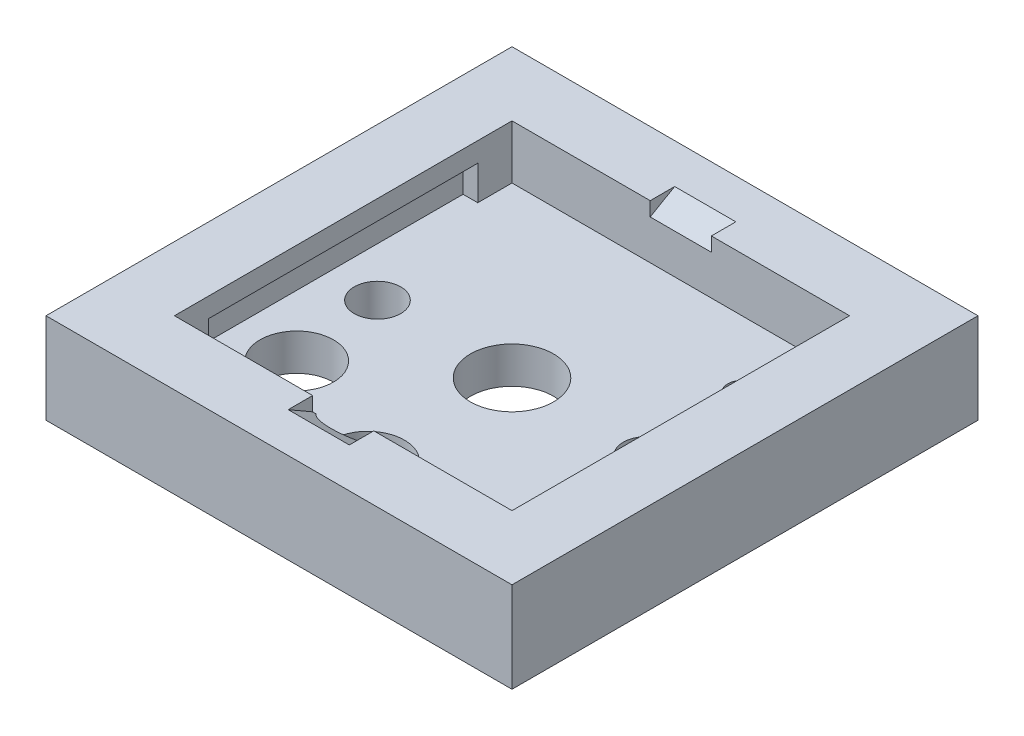
ISO-10303-21;
HEADER;
FILE_DESCRIPTION(('STEP AP214'),'2;1');
FILE_NAME('part.step','',(''),(''),'','','');
FILE_SCHEMA(('AUTOMOTIVE_DESIGN { 1 0 10303 214 1 1 1 1 }'));
ENDSEC;
DATA;
#1=APPLICATION_CONTEXT('core data for automotive mechanical design processes');
#2=APPLICATION_PROTOCOL_DEFINITION('international standard','automotive_design',2000,#1);
#3=PRODUCT_CONTEXT('',#1,'mechanical');
#4=PRODUCT('Part','Part','',(#3));
#5=PRODUCT_RELATED_PRODUCT_CATEGORY('part','',(#4));
#6=PRODUCT_DEFINITION_FORMATION('','',#4);
#7=PRODUCT_DEFINITION_CONTEXT('part definition',#1,'design');
#8=PRODUCT_DEFINITION('design','',#6,#7);
#9=PRODUCT_DEFINITION_SHAPE('','',#8);
#10=(LENGTH_UNIT() NAMED_UNIT(*) SI_UNIT(.MILLI.,.METRE.));
#11=(NAMED_UNIT(*) PLANE_ANGLE_UNIT() SI_UNIT($,.RADIAN.));
#12=(NAMED_UNIT(*) SI_UNIT($,.STERADIAN.) SOLID_ANGLE_UNIT());
#13=UNCERTAINTY_MEASURE_WITH_UNIT(LENGTH_MEASURE(1.E-05),#10,'distance_accuracy_value','');
#14=(GEOMETRIC_REPRESENTATION_CONTEXT(3) GLOBAL_UNCERTAINTY_ASSIGNED_CONTEXT((#13)) GLOBAL_UNIT_ASSIGNED_CONTEXT((#10,
#11,#12)) REPRESENTATION_CONTEXT('',''));
#15=CARTESIAN_POINT('',(0.,0.,0.));
#16=DIRECTION('',(0.,0.,1.));
#17=DIRECTION('',(1.,0.,0.));
#18=AXIS2_PLACEMENT_3D('',#15,#16,#17);
#19=CARTESIAN_POINT('',(0.,3.7,0.));
#20=DIRECTION('',(0.,1.,0.));
#21=DIRECTION('',(0.,0.,1.));
#22=AXIS2_PLACEMENT_3D('',#19,#20,#21);
#23=PLANE('',#22);
#24=DIRECTION('',(1.,0.,0.));
#25=VECTOR('',#24,1.);
#26=CARTESIAN_POINT('',(0.,3.7,9.525));
#27=LINE('',#26,#25);
#28=CARTESIAN_POINT('',(-9.525,3.7,9.525));
#29=VERTEX_POINT('',#28);
#30=CARTESIAN_POINT('',(9.525,3.7,9.525));
#31=VERTEX_POINT('',#30);
#32=EDGE_CURVE('E580',#29,#31,#27,.T.);
#33=ORIENTED_EDGE('',*,*,#32,.T.);
#34=DIRECTION('',(0.,0.,-1.));
#35=VECTOR('',#34,1.);
#36=CARTESIAN_POINT('',(9.525,3.7,0.));
#37=LINE('',#36,#35);
#38=CARTESIAN_POINT('',(9.525,3.7,-9.525));
#39=VERTEX_POINT('',#38);
#40=EDGE_CURVE('E584',#31,#39,#37,.T.);
#41=ORIENTED_EDGE('',*,*,#40,.T.);
#42=DIRECTION('',(1.,0.,0.));
#43=VECTOR('',#42,1.);
#44=CARTESIAN_POINT('',(0.,3.7,-9.525));
#45=LINE('',#44,#43);
#46=CARTESIAN_POINT('',(-9.525,3.7,-9.525));
#47=VERTEX_POINT('',#46);
#48=EDGE_CURVE('E588',#47,#39,#45,.T.);
#49=ORIENTED_EDGE('',*,*,#48,.F.);
#50=DIRECTION('',(0.,0.,-1.));
#51=VECTOR('',#50,1.);
#52=CARTESIAN_POINT('',(-9.525,3.7,0.));
#53=LINE('',#52,#51);
#54=EDGE_CURVE('E592',#29,#47,#53,.T.);
#55=ORIENTED_EDGE('',*,*,#54,.F.);
#56=EDGE_LOOP('',(#33,#41,#49,#55));
#57=FACE_BOUND('',#56,.T.);
#58=DIRECTION('',(-1.,0.,0.));
#59=VECTOR('',#58,1.);
#60=CARTESIAN_POINT('',(0.,3.7,-6.9));
#61=LINE('',#60,#59);
#62=CARTESIAN_POINT('',(-1.25,3.7,-6.9));
#63=VERTEX_POINT('',#62);
#64=CARTESIAN_POINT('',(-6.89999999999999,3.7,-6.9));
#65=VERTEX_POINT('',#64);
#66=EDGE_CURVE('E547',#63,#65,#61,.T.);
#67=ORIENTED_EDGE('',*,*,#66,.F.);
#68=DIRECTION('',(0.,0.,-1.));
#69=VECTOR('',#68,1.);
#70=CARTESIAN_POINT('',(-1.25,3.7,-7.9));
#71=LINE('',#70,#69);
#72=CARTESIAN_POINT('',(-1.25,3.7,-7.9));
#73=VERTEX_POINT('',#72);
#74=EDGE_CURVE('E434',#63,#73,#71,.T.);
#75=ORIENTED_EDGE('',*,*,#74,.T.);
#76=DIRECTION('',(1.,0.,0.));
#77=VECTOR('',#76,1.);
#78=CARTESIAN_POINT('',(-1.25,3.7,-7.9));
#79=LINE('',#78,#77);
#80=CARTESIAN_POINT('',(1.25,3.7,-7.9));
#81=VERTEX_POINT('',#80);
#82=EDGE_CURVE('E443',#73,#81,#79,.T.);
#83=ORIENTED_EDGE('',*,*,#82,.T.);
#84=DIRECTION('',(0.,0.,-1.));
#85=VECTOR('',#84,1.);
#86=CARTESIAN_POINT('',(1.25,3.7,-7.9));
#87=LINE('',#86,#85);
#88=CARTESIAN_POINT('',(1.25,3.7,-6.9));
#89=VERTEX_POINT('',#88);
#90=EDGE_CURVE('E446',#89,#81,#87,.T.);
#91=ORIENTED_EDGE('',*,*,#90,.F.);
#92=CARTESIAN_POINT('',(6.90000000000001,3.7,-6.9));
#93=VERTEX_POINT('',#92);
#94=EDGE_CURVE('E548',#93,#89,#61,.T.);
#95=ORIENTED_EDGE('',*,*,#94,.F.);
#96=DIRECTION('',(0.,0.,-1.));
#97=VECTOR('',#96,1.);
#98=CARTESIAN_POINT('',(6.90000000000001,3.7,0.));
#99=LINE('',#98,#97);
#100=CARTESIAN_POINT('',(6.90000000000001,3.7,6.9));
#101=VERTEX_POINT('',#100);
#102=EDGE_CURVE('E552',#101,#93,#99,.T.);
#103=ORIENTED_EDGE('',*,*,#102,.F.);
#104=DIRECTION('',(1.,0.,0.));
#105=VECTOR('',#104,1.);
#106=CARTESIAN_POINT('',(0.,3.7,6.9));
#107=LINE('',#106,#105);
#108=CARTESIAN_POINT('',(1.25,3.7,6.9));
#109=VERTEX_POINT('',#108);
#110=EDGE_CURVE('E517',#109,#101,#107,.T.);
#111=ORIENTED_EDGE('',*,*,#110,.F.);
#112=DIRECTION('',(0.,0.,1.));
#113=VECTOR('',#112,1.);
#114=CARTESIAN_POINT('',(1.25,3.7,7.9));
#115=LINE('',#114,#113);
#116=CARTESIAN_POINT('',(1.25,3.7,7.9));
#117=VERTEX_POINT('',#116);
#118=EDGE_CURVE('E464',#109,#117,#115,.T.);
#119=ORIENTED_EDGE('',*,*,#118,.T.);
#120=DIRECTION('',(1.,0.,0.));
#121=VECTOR('',#120,1.);
#122=CARTESIAN_POINT('',(-1.25,3.7,7.9));
#123=LINE('',#122,#121);
#124=CARTESIAN_POINT('',(-1.25,3.7,7.9));
#125=VERTEX_POINT('',#124);
#126=EDGE_CURVE('E482',#125,#117,#123,.T.);
#127=ORIENTED_EDGE('',*,*,#126,.F.);
#128=DIRECTION('',(0.,0.,1.));
#129=VECTOR('',#128,1.);
#130=CARTESIAN_POINT('',(-1.25,3.7,7.9));
#131=LINE('',#130,#129);
#132=CARTESIAN_POINT('',(-1.25,3.7,6.9));
#133=VERTEX_POINT('',#132);
#134=EDGE_CURVE('E467',#133,#125,#131,.T.);
#135=ORIENTED_EDGE('',*,*,#134,.F.);
#136=DIRECTION('',(1.,0.,0.));
#137=VECTOR('',#136,1.);
#138=CARTESIAN_POINT('',(0.,3.7,6.9));
#139=LINE('',#138,#137);
#140=CARTESIAN_POINT('',(-6.89999999999999,3.7,6.9));
#141=VERTEX_POINT('',#140);
#142=EDGE_CURVE('E511',#141,#133,#139,.T.);
#143=ORIENTED_EDGE('',*,*,#142,.F.);
#144=DIRECTION('',(0.,0.,1.));
#145=VECTOR('',#144,1.);
#146=CARTESIAN_POINT('',(-6.89999999999999,3.7,0.));
#147=LINE('',#146,#145);
#148=EDGE_CURVE('E543',#65,#141,#147,.T.);
#149=ORIENTED_EDGE('',*,*,#148,.F.);
#150=EDGE_LOOP('',(#67,#75,#83,#91,#95,#103,#111,#119,#127,#135,#143,#149));
#151=FACE_BOUND('',#150,.T.);
#152=ADVANCED_FACE('F148',(#57,#151),#23,.T.);
#153=CARTESIAN_POINT('',(0.,1.5,-6.9));
#154=DIRECTION('',(0.,0.,-1.));
#155=DIRECTION('',(-1.,0.,0.));
#156=AXIS2_PLACEMENT_3D('',#153,#154,#155);
#157=PLANE('',#156);
#158=DIRECTION('',(0.,1.,0.));
#159=VECTOR('',#158,1.);
#160=CARTESIAN_POINT('',(-1.25,3.7,-6.9));
#161=LINE('',#160,#159);
#162=CARTESIAN_POINT('',(-1.25,3.12264973081038,-6.9));
#163=VERTEX_POINT('',#162);
#164=EDGE_CURVE('E439',#163,#63,#161,.T.);
#165=ORIENTED_EDGE('',*,*,#164,.T.);
#166=ORIENTED_EDGE('',*,*,#66,.T.);
#167=DIRECTION('',(0.,1.,0.));
#168=VECTOR('',#167,1.);
#169=CARTESIAN_POINT('',(-6.89999999999999,1.5,-6.9));
#170=LINE('',#169,#168);
#171=CARTESIAN_POINT('',(-6.89999999999999,1.5,-6.9));
#172=VERTEX_POINT('',#171);
#173=EDGE_CURVE('E568',#172,#65,#170,.T.);
#174=ORIENTED_EDGE('',*,*,#173,.F.);
#175=DIRECTION('',(-1.,0.,0.));
#176=VECTOR('',#175,1.);
#177=CARTESIAN_POINT('',(0.,1.5,-6.9));
#178=LINE('',#177,#176);
#179=CARTESIAN_POINT('',(6.90000000000001,1.5,-6.9));
#180=VERTEX_POINT('',#179);
#181=EDGE_CURVE('E526',#180,#172,#178,.T.);
#182=ORIENTED_EDGE('',*,*,#181,.F.);
#183=DIRECTION('',(0.,1.,0.));
#184=VECTOR('',#183,1.);
#185=CARTESIAN_POINT('',(6.90000000000001,1.5,-6.9));
#186=LINE('',#185,#184);
#187=EDGE_CURVE('E565',#180,#93,#186,.T.);
#188=ORIENTED_EDGE('',*,*,#187,.T.);
#189=ORIENTED_EDGE('',*,*,#94,.T.);
#190=DIRECTION('',(0.,1.,0.));
#191=VECTOR('',#190,1.);
#192=CARTESIAN_POINT('',(1.25,3.7,-6.9));
#193=LINE('',#192,#191);
#194=CARTESIAN_POINT('',(1.25,3.12264973081038,-6.9));
#195=VERTEX_POINT('',#194);
#196=EDGE_CURVE('E435',#195,#89,#193,.T.);
#197=ORIENTED_EDGE('',*,*,#196,.F.);
#198=DIRECTION('',(1.,0.,0.));
#199=VECTOR('',#198,1.);
#200=CARTESIAN_POINT('',(-1.25,3.12264973081038,-6.9));
#201=LINE('',#200,#199);
#202=EDGE_CURVE('E451',#163,#195,#201,.T.);
#203=ORIENTED_EDGE('',*,*,#202,.F.);
#204=EDGE_LOOP('',(#165,#166,#174,#182,#188,#189,#197,#203));
#205=FACE_BOUND('',#204,.T.);
#206=ADVANCED_FACE('F666',(#205),#157,.F.);
#207=CARTESIAN_POINT('',(5.50000000000001,3.7,0.));
#208=DIRECTION('',(0.,-1.,0.));
#209=DIRECTION('',(0.,0.,-1.));
#210=AXIS2_PLACEMENT_3D('',#207,#208,#209);
#211=CYLINDRICAL_SURFACE('',#210,0.949999999999999);
#212=CARTESIAN_POINT('',(5.50000000000001,0.,0.));
#213=DIRECTION('',(0.,1.,0.));
#214=DIRECTION('',(0.,0.,1.));
#215=AXIS2_PLACEMENT_3D('',#212,#213,#214);
#216=CIRCLE('',#215,0.949999999999999);
#217=CARTESIAN_POINT('',(5.50000000000001,0.,0.95));
#218=VERTEX_POINT('',#217);
#219=EDGE_CURVE('E628',#218,#218,#216,.T.);
#220=ORIENTED_EDGE('',*,*,#219,.F.);
#221=EDGE_LOOP('',(#220));
#222=FACE_BOUND('',#221,.T.);
#223=CARTESIAN_POINT('',(5.50000000000001,1.5,0.));
#224=DIRECTION('',(0.,1.,0.));
#225=DIRECTION('',(0.,0.,1.));
#226=AXIS2_PLACEMENT_3D('',#223,#224,#225);
#227=CIRCLE('',#226,0.949999999999999);
#228=CARTESIAN_POINT('',(5.50000000000001,1.5,0.95));
#229=VERTEX_POINT('',#228);
#230=EDGE_CURVE('E499',#229,#229,#227,.T.);
#231=ORIENTED_EDGE('',*,*,#230,.T.);
#232=EDGE_LOOP('',(#231));
#233=FACE_BOUND('',#232,.T.);
#234=ADVANCED_FACE('F776',(#222,#233),#211,.F.);
#235=CARTESIAN_POINT('',(-5.49999999999999,3.7,0.));
#236=DIRECTION('',(0.,-1.,0.));
#237=DIRECTION('',(0.,0.,-1.));
#238=AXIS2_PLACEMENT_3D('',#235,#236,#237);
#239=CYLINDRICAL_SURFACE('',#238,0.95);
#240=CARTESIAN_POINT('',(-5.49999999999999,0.,0.));
#241=DIRECTION('',(0.,1.,0.));
#242=DIRECTION('',(0.,0.,1.));
#243=AXIS2_PLACEMENT_3D('',#240,#241,#242);
#244=CIRCLE('',#243,0.95);
#245=CARTESIAN_POINT('',(-5.49999999999999,0.,0.949999999999998));
#246=VERTEX_POINT('',#245);
#247=EDGE_CURVE('E624',#246,#246,#244,.T.);
#248=ORIENTED_EDGE('',*,*,#247,.F.);
#249=EDGE_LOOP('',(#248));
#250=FACE_BOUND('',#249,.T.);
#251=CARTESIAN_POINT('',(-5.49999999999999,1.5,0.));
#252=DIRECTION('',(0.,1.,0.));
#253=DIRECTION('',(0.,0.,1.));
#254=AXIS2_PLACEMENT_3D('',#251,#252,#253);
#255=CIRCLE('',#254,0.95);
#256=CARTESIAN_POINT('',(-5.49999999999999,1.5,0.949999999999998));
#257=VERTEX_POINT('',#256);
#258=EDGE_CURVE('E495',#257,#257,#255,.T.);
#259=ORIENTED_EDGE('',*,*,#258,.T.);
#260=EDGE_LOOP('',(#259));
#261=FACE_BOUND('',#260,.T.);
#262=ADVANCED_FACE('F792',(#250,#261),#239,.F.);
#263=CARTESIAN_POINT('',(0.,3.7,0.));
#264=DIRECTION('',(0.,-1.,0.));
#265=DIRECTION('',(0.,0.,-1.));
#266=AXIS2_PLACEMENT_3D('',#263,#264,#265);
#267=CYLINDRICAL_SURFACE('',#266,1.7);
#268=CARTESIAN_POINT('',(0.,0.,0.));
#269=DIRECTION('',(0.,1.,0.));
#270=DIRECTION('',(0.,0.,1.));
#271=AXIS2_PLACEMENT_3D('',#268,#269,#270);
#272=CIRCLE('',#271,1.7);
#273=CARTESIAN_POINT('',(0.,0.,1.7));
#274=VERTEX_POINT('',#273);
#275=EDGE_CURVE('E620',#274,#274,#272,.T.);
#276=ORIENTED_EDGE('',*,*,#275,.F.);
#277=EDGE_LOOP('',(#276));
#278=FACE_BOUND('',#277,.T.);
#279=CARTESIAN_POINT('',(0.,1.5,0.));
#280=DIRECTION('',(0.,1.,0.));
#281=DIRECTION('',(0.,0.,1.));
#282=AXIS2_PLACEMENT_3D('',#279,#280,#281);
#283=CIRCLE('',#282,1.7);
#284=CARTESIAN_POINT('',(0.,1.5,1.7));
#285=VERTEX_POINT('',#284);
#286=EDGE_CURVE('E507',#285,#285,#283,.T.);
#287=ORIENTED_EDGE('',*,*,#286,.T.);
#288=EDGE_LOOP('',(#287));
#289=FACE_BOUND('',#288,.T.);
#290=ADVANCED_FACE('F796',(#278,#289),#267,.F.);
#291=CARTESIAN_POINT('',(5.22,3.7,-4.2));
#292=DIRECTION('',(0.,-1.,0.));
#293=DIRECTION('',(0.,0.,-1.));
#294=AXIS2_PLACEMENT_3D('',#291,#292,#293);
#295=CYLINDRICAL_SURFACE('',#294,0.6);
#296=CARTESIAN_POINT('',(5.22,0.,-4.2));
#297=DIRECTION('',(0.,1.,0.));
#298=DIRECTION('',(0.,0.,1.));
#299=AXIS2_PLACEMENT_3D('',#296,#297,#298);
#300=CIRCLE('',#299,0.6);
#301=CARTESIAN_POINT('',(5.22,0.,-3.6));
#302=VERTEX_POINT('',#301);
#303=EDGE_CURVE('E616',#302,#302,#300,.T.);
#304=ORIENTED_EDGE('',*,*,#303,.F.);
#305=EDGE_LOOP('',(#304));
#306=FACE_BOUND('',#305,.T.);
#307=CARTESIAN_POINT('',(5.22,1.5,-4.2));
#308=DIRECTION('',(0.,1.,0.));
#309=DIRECTION('',(0.,0.,1.));
#310=AXIS2_PLACEMENT_3D('',#307,#308,#309);
#311=CIRCLE('',#310,0.6);
#312=CARTESIAN_POINT('',(5.22,1.5,-3.6));
#313=VERTEX_POINT('',#312);
#314=EDGE_CURVE('E491',#313,#313,#311,.T.);
#315=ORIENTED_EDGE('',*,*,#314,.T.);
#316=EDGE_LOOP('',(#315));
#317=FACE_BOUND('',#316,.T.);
#318=ADVANCED_FACE('F788',(#306,#317),#295,.F.);
#319=CARTESIAN_POINT('',(-5.,3.7,3.8));
#320=DIRECTION('',(0.,-1.,0.));
#321=DIRECTION('',(0.,0.,-1.));
#322=AXIS2_PLACEMENT_3D('',#319,#320,#321);
#323=CYLINDRICAL_SURFACE('',#322,1.5);
#324=CARTESIAN_POINT('',(-5.,0.,3.8));
#325=DIRECTION('',(0.,1.,0.));
#326=DIRECTION('',(0.,0.,1.));
#327=AXIS2_PLACEMENT_3D('',#324,#325,#326);
#328=CIRCLE('',#327,1.5);
#329=CARTESIAN_POINT('',(-5.,0.,5.3));
#330=VERTEX_POINT('',#329);
#331=EDGE_CURVE('E585',#330,#330,#328,.T.);
#332=ORIENTED_EDGE('',*,*,#331,.F.);
#333=EDGE_LOOP('',(#332));
#334=FACE_BOUND('',#333,.T.);
#335=CARTESIAN_POINT('',(-5.,1.5,3.8));
#336=DIRECTION('',(0.,1.,0.));
#337=DIRECTION('',(0.,0.,1.));
#338=AXIS2_PLACEMENT_3D('',#335,#336,#337);
#339=CIRCLE('',#338,1.5);
#340=CARTESIAN_POINT('',(-5.,1.5,5.3));
#341=VERTEX_POINT('',#340);
#342=EDGE_CURVE('E503',#341,#341,#339,.T.);
#343=ORIENTED_EDGE('',*,*,#342,.T.);
#344=EDGE_LOOP('',(#343));
#345=FACE_BOUND('',#344,.T.);
#346=ADVANCED_FACE('F785',(#334,#345),#323,.F.);
#347=CARTESIAN_POINT('',(0.,3.7,9.525));
#348=DIRECTION('',(0.,0.,-1.));
#349=DIRECTION('',(-1.,0.,0.));
#350=AXIS2_PLACEMENT_3D('',#347,#348,#349);
#351=PLANE('',#350);
#352=DIRECTION('',(1.,0.,0.));
#353=VECTOR('',#352,1.);
#354=CARTESIAN_POINT('',(0.,0.,9.525));
#355=LINE('',#354,#353);
#356=CARTESIAN_POINT('',(-9.525,0.,9.525));
#357=VERTEX_POINT('',#356);
#358=CARTESIAN_POINT('',(9.525,0.,9.525));
#359=VERTEX_POINT('',#358);
#360=EDGE_CURVE('E600',#357,#359,#355,.T.);
#361=ORIENTED_EDGE('',*,*,#360,.T.);
#362=DIRECTION('',(0.,-1.,0.));
#363=VECTOR('',#362,1.);
#364=CARTESIAN_POINT('',(9.525,3.7,9.525));
#365=LINE('',#364,#363);
#366=EDGE_CURVE('E157',#31,#359,#365,.T.);
#367=ORIENTED_EDGE('',*,*,#366,.F.);
#368=ORIENTED_EDGE('',*,*,#32,.F.);
#369=DIRECTION('',(0.,-1.,0.));
#370=VECTOR('',#369,1.);
#371=CARTESIAN_POINT('',(-9.525,3.7,9.525));
#372=LINE('',#371,#370);
#373=EDGE_CURVE('E596',#29,#357,#372,.T.);
#374=ORIENTED_EDGE('',*,*,#373,.T.);
#375=EDGE_LOOP('',(#361,#367,#368,#374));
#376=FACE_BOUND('',#375,.T.);
#377=ADVANCED_FACE('F651',(#376),#351,.F.);
#378=CARTESIAN_POINT('',(9.525,3.7,0.));
#379=DIRECTION('',(-1.,0.,0.));
#380=DIRECTION('',(0.,0.,1.));
#381=AXIS2_PLACEMENT_3D('',#378,#379,#380);
#382=PLANE('',#381);
#383=DIRECTION('',(0.,0.,-1.));
#384=VECTOR('',#383,1.);
#385=CARTESIAN_POINT('',(9.525,0.,0.));
#386=LINE('',#385,#384);
#387=CARTESIAN_POINT('',(9.525,0.,-9.525));
#388=VERTEX_POINT('',#387);
#389=EDGE_CURVE('E604',#359,#388,#386,.T.);
#390=ORIENTED_EDGE('',*,*,#389,.T.);
#391=DIRECTION('',(0.,-1.,0.));
#392=VECTOR('',#391,1.);
#393=CARTESIAN_POINT('',(9.525,3.7,-9.525));
#394=LINE('',#393,#392);
#395=EDGE_CURVE('E640',#39,#388,#394,.T.);
#396=ORIENTED_EDGE('',*,*,#395,.F.);
#397=ORIENTED_EDGE('',*,*,#40,.F.);
#398=ORIENTED_EDGE('',*,*,#366,.T.);
#399=EDGE_LOOP('',(#390,#396,#397,#398));
#400=FACE_BOUND('',#399,.T.);
#401=ADVANCED_FACE('F646',(#400),#382,.F.);
#402=CARTESIAN_POINT('',(0.,3.7,-9.525));
#403=DIRECTION('',(0.,0.,-1.));
#404=DIRECTION('',(-1.,0.,0.));
#405=AXIS2_PLACEMENT_3D('',#402,#403,#404);
#406=PLANE('',#405);
#407=DIRECTION('',(1.,0.,0.));
#408=VECTOR('',#407,1.);
#409=CARTESIAN_POINT('',(0.,0.,-9.525));
#410=LINE('',#409,#408);
#411=CARTESIAN_POINT('',(-9.525,0.,-9.525));
#412=VERTEX_POINT('',#411);
#413=EDGE_CURVE('E608',#412,#388,#410,.T.);
#414=ORIENTED_EDGE('',*,*,#413,.F.);
#415=DIRECTION('',(0.,-1.,0.));
#416=VECTOR('',#415,1.);
#417=CARTESIAN_POINT('',(-9.525,3.7,-9.525));
#418=LINE('',#417,#416);
#419=EDGE_CURVE('E637',#47,#412,#418,.T.);
#420=ORIENTED_EDGE('',*,*,#419,.F.);
#421=ORIENTED_EDGE('',*,*,#48,.T.);
#422=ORIENTED_EDGE('',*,*,#395,.T.);
#423=EDGE_LOOP('',(#414,#420,#421,#422));
#424=FACE_BOUND('',#423,.T.);
#425=ADVANCED_FACE('F662',(#424),#406,.T.);
#426=CARTESIAN_POINT('',(-9.525,3.7,0.));
#427=DIRECTION('',(-1.,0.,0.));
#428=DIRECTION('',(0.,0.,1.));
#429=AXIS2_PLACEMENT_3D('',#426,#427,#428);
#430=PLANE('',#429);
#431=DIRECTION('',(0.,0.,-1.));
#432=VECTOR('',#431,1.);
#433=CARTESIAN_POINT('',(-9.525,0.,0.));
#434=LINE('',#433,#432);
#435=EDGE_CURVE('E612',#357,#412,#434,.T.);
#436=ORIENTED_EDGE('',*,*,#435,.F.);
#437=ORIENTED_EDGE('',*,*,#373,.F.);
#438=ORIENTED_EDGE('',*,*,#54,.T.);
#439=ORIENTED_EDGE('',*,*,#419,.T.);
#440=EDGE_LOOP('',(#436,#437,#438,#439));
#441=FACE_BOUND('',#440,.T.);
#442=ADVANCED_FACE('F657',(#441),#430,.T.);
#443=CARTESIAN_POINT('',(0.,3.7,5.9));
#444=DIRECTION('',(0.,-1.,0.));
#445=DIRECTION('',(0.,0.,-1.));
#446=AXIS2_PLACEMENT_3D('',#443,#444,#445);
#447=CYLINDRICAL_SURFACE('',#446,1.5);
#448=CARTESIAN_POINT('',(0.,2.54529946162076,5.9));
#449=DIRECTION('',(0.,-0.866025403784442,0.499999999999995));
#450=DIRECTION('',(0.,-0.499999999999995,-0.866025403784442));
#451=AXIS2_PLACEMENT_3D('',#448,#449,#450);
#452=ELLIPSE('',#451,1.73205080756887,1.5);
#453=CARTESIAN_POINT('',(1.11803398874989,3.12264973081038,6.9));
#454=VERTEX_POINT('',#453);
#455=CARTESIAN_POINT('',(-1.11803398874989,3.12264973081038,6.9));
#456=VERTEX_POINT('',#455);
#457=EDGE_CURVE('E485',#454,#456,#452,.T.);
#458=ORIENTED_EDGE('',*,*,#457,.F.);
#459=DIRECTION('',(0.,1.,0.));
#460=VECTOR('',#459,1.);
#461=CARTESIAN_POINT('',(1.11803398874989,1.5,6.9));
#462=LINE('',#461,#460);
#463=CARTESIAN_POINT('',(1.11803398874989,1.5,6.9));
#464=VERTEX_POINT('',#463);
#465=EDGE_CURVE('E539',#464,#454,#462,.T.);
#466=ORIENTED_EDGE('',*,*,#465,.F.);
#467=CARTESIAN_POINT('',(0.,1.5,5.9));
#468=DIRECTION('',(0.,1.,0.));
#469=DIRECTION('',(0.,0.,1.));
#470=AXIS2_PLACEMENT_3D('',#467,#468,#469);
#471=CIRCLE('',#470,1.5);
#472=CARTESIAN_POINT('',(-1.11803398874989,1.5,6.9));
#473=VERTEX_POINT('',#472);
#474=EDGE_CURVE('E512',#464,#473,#471,.T.);
#475=ORIENTED_EDGE('',*,*,#474,.T.);
#476=DIRECTION('',(0.,1.,0.));
#477=VECTOR('',#476,1.);
#478=CARTESIAN_POINT('',(-1.11803398874989,1.5,6.9));
#479=LINE('',#478,#477);
#480=EDGE_CURVE('E575',#473,#456,#479,.T.);
#481=ORIENTED_EDGE('',*,*,#480,.T.);
#482=EDGE_LOOP('',(#458,#466,#475,#481));
#483=FACE_BOUND('',#482,.T.);
#484=CARTESIAN_POINT('',(0.,0.,5.9));
#485=DIRECTION('',(0.,1.,0.));
#486=DIRECTION('',(0.,0.,1.));
#487=AXIS2_PLACEMENT_3D('',#484,#485,#486);
#488=CIRCLE('',#487,1.5);
#489=CARTESIAN_POINT('',(0.,0.,7.4));
#490=VERTEX_POINT('',#489);
#491=EDGE_CURVE('E579',#490,#490,#488,.T.);
#492=ORIENTED_EDGE('',*,*,#491,.F.);
#493=EDGE_LOOP('',(#492));
#494=FACE_BOUND('',#493,.T.);
#495=ADVANCED_FACE('F150',(#483,#494),#447,.F.);
#496=CARTESIAN_POINT('',(0.,0.,0.));
#497=DIRECTION('',(0.,1.,0.));
#498=DIRECTION('',(0.,0.,1.));
#499=AXIS2_PLACEMENT_3D('',#496,#497,#498);
#500=PLANE('',#499);
#501=ORIENTED_EDGE('',*,*,#491,.T.);
#502=EDGE_LOOP('',(#501));
#503=FACE_BOUND('',#502,.T.);
#504=ORIENTED_EDGE('',*,*,#360,.F.);
#505=ORIENTED_EDGE('',*,*,#435,.T.);
#506=ORIENTED_EDGE('',*,*,#413,.T.);
#507=ORIENTED_EDGE('',*,*,#389,.F.);
#508=EDGE_LOOP('',(#504,#505,#506,#507));
#509=FACE_BOUND('',#508,.T.);
#510=ORIENTED_EDGE('',*,*,#303,.T.);
#511=EDGE_LOOP('',(#510));
#512=FACE_BOUND('',#511,.T.);
#513=ORIENTED_EDGE('',*,*,#275,.T.);
#514=EDGE_LOOP('',(#513));
#515=FACE_BOUND('',#514,.T.);
#516=ORIENTED_EDGE('',*,*,#247,.T.);
#517=EDGE_LOOP('',(#516));
#518=FACE_BOUND('',#517,.T.);
#519=ORIENTED_EDGE('',*,*,#219,.T.);
#520=EDGE_LOOP('',(#519));
#521=FACE_BOUND('',#520,.T.);
#522=ORIENTED_EDGE('',*,*,#331,.T.);
#523=EDGE_LOOP('',(#522));
#524=FACE_BOUND('',#523,.T.);
#525=ADVANCED_FACE('F654',(#503,#509,#512,#515,#518,#521,#524),#500,.F.);
#526=CARTESIAN_POINT('',(0.,1.5,6.9));
#527=DIRECTION('',(0.,0.,1.));
#528=DIRECTION('',(1.,0.,0.));
#529=AXIS2_PLACEMENT_3D('',#526,#527,#528);
#530=PLANE('',#529);
#531=DIRECTION('',(0.,1.,0.));
#532=VECTOR('',#531,1.);
#533=CARTESIAN_POINT('',(-1.25,3.7,6.9));
#534=LINE('',#533,#532);
#535=CARTESIAN_POINT('',(-1.25,3.12264973081038,6.9));
#536=VERTEX_POINT('',#535);
#537=EDGE_CURVE('E463',#536,#133,#534,.T.);
#538=ORIENTED_EDGE('',*,*,#537,.F.);
#539=DIRECTION('',(1.,0.,0.));
#540=VECTOR('',#539,1.);
#541=CARTESIAN_POINT('',(-1.25,3.12264973081038,6.9));
#542=LINE('',#541,#540);
#543=EDGE_CURVE('E471',#536,#456,#542,.T.);
#544=ORIENTED_EDGE('',*,*,#543,.T.);
#545=ORIENTED_EDGE('',*,*,#480,.F.);
#546=DIRECTION('',(1.,0.,0.));
#547=VECTOR('',#546,1.);
#548=CARTESIAN_POINT('',(0.,1.5,6.9));
#549=LINE('',#548,#547);
#550=CARTESIAN_POINT('',(-6.89999999999999,1.5,6.9));
#551=VERTEX_POINT('',#550);
#552=EDGE_CURVE('E516',#551,#473,#549,.T.);
#553=ORIENTED_EDGE('',*,*,#552,.F.);
#554=DIRECTION('',(0.,1.,0.));
#555=VECTOR('',#554,1.);
#556=CARTESIAN_POINT('',(-6.89999999999999,1.5,6.9));
#557=LINE('',#556,#555);
#558=EDGE_CURVE('E572',#551,#141,#557,.T.);
#559=ORIENTED_EDGE('',*,*,#558,.T.);
#560=ORIENTED_EDGE('',*,*,#142,.T.);
#561=EDGE_LOOP('',(#538,#544,#545,#553,#559,#560));
#562=FACE_BOUND('',#561,.T.);
#563=ADVANCED_FACE('F779',(#562),#530,.F.);
#564=CARTESIAN_POINT('',(-6.89999999999999,1.5,0.));
#565=DIRECTION('',(-1.,0.,0.));
#566=DIRECTION('',(0.,0.,1.));
#567=AXIS2_PLACEMENT_3D('',#564,#565,#566);
#568=PLANE('',#567);
#569=DIRECTION('',(0.,0.,1.));
#570=VECTOR('',#569,1.);
#571=CARTESIAN_POINT('',(-6.89999999999999,2.9,-5.5));
#572=LINE('',#571,#570);
#573=CARTESIAN_POINT('',(-6.89999999999999,2.9,-5.5));
#574=VERTEX_POINT('',#573);
#575=CARTESIAN_POINT('',(-6.89999999999999,2.9,5.5));
#576=VERTEX_POINT('',#575);
#577=EDGE_CURVE('E425',#574,#576,#572,.T.);
#578=ORIENTED_EDGE('',*,*,#577,.F.);
#579=DIRECTION('',(0.,1.,0.));
#580=VECTOR('',#579,1.);
#581=CARTESIAN_POINT('',(-6.89999999999999,2.9,-5.5));
#582=LINE('',#581,#580);
#583=CARTESIAN_POINT('',(-6.89999999999999,1.5,-5.5));
#584=VERTEX_POINT('',#583);
#585=EDGE_CURVE('E389',#584,#574,#582,.T.);
#586=ORIENTED_EDGE('',*,*,#585,.F.);
#587=DIRECTION('',(0.,0.,1.));
#588=VECTOR('',#587,1.);
#589=CARTESIAN_POINT('',(-6.89999999999999,1.5,0.));
#590=LINE('',#589,#588);
#591=EDGE_CURVE('E522',#172,#584,#590,.T.);
#592=ORIENTED_EDGE('',*,*,#591,.F.);
#593=ORIENTED_EDGE('',*,*,#173,.T.);
#594=ORIENTED_EDGE('',*,*,#148,.T.);
#595=ORIENTED_EDGE('',*,*,#558,.F.);
#596=CARTESIAN_POINT('',(-6.89999999999999,1.5,5.5));
#597=VERTEX_POINT('',#596);
#598=EDGE_CURVE('E521',#597,#551,#590,.T.);
#599=ORIENTED_EDGE('',*,*,#598,.F.);
#600=DIRECTION('',(0.,1.,0.));
#601=VECTOR('',#600,1.);
#602=CARTESIAN_POINT('',(-6.89999999999999,2.9,5.5));
#603=LINE('',#602,#601);
#604=EDGE_CURVE('E407',#597,#576,#603,.T.);
#605=ORIENTED_EDGE('',*,*,#604,.T.);
#606=EDGE_LOOP('',(#578,#586,#592,#593,#594,#595,#599,#605));
#607=FACE_BOUND('',#606,.T.);
#608=ADVANCED_FACE('F687',(#607),#568,.F.);
#609=CARTESIAN_POINT('',(6.90000000000001,1.5,0.));
#610=DIRECTION('',(1.,0.,0.));
#611=DIRECTION('',(0.,0.,-1.));
#612=AXIS2_PLACEMENT_3D('',#609,#610,#611);
#613=PLANE('',#612);
#614=DIRECTION('',(0.,0.,-1.));
#615=VECTOR('',#614,1.);
#616=CARTESIAN_POINT('',(6.90000000000001,1.5,0.));
#617=LINE('',#616,#615);
#618=CARTESIAN_POINT('',(6.90000000000001,1.5,-5.5));
#619=VERTEX_POINT('',#618);
#620=EDGE_CURVE('E530',#619,#180,#617,.T.);
#621=ORIENTED_EDGE('',*,*,#620,.F.);
#622=DIRECTION('',(0.,1.,0.));
#623=VECTOR('',#622,1.);
#624=CARTESIAN_POINT('',(6.89999999999999,2.9,-5.5));
#625=LINE('',#624,#623);
#626=CARTESIAN_POINT('',(6.89999999999999,2.9,-5.5));
#627=VERTEX_POINT('',#626);
#628=EDGE_CURVE('E164',#619,#627,#625,.T.);
#629=ORIENTED_EDGE('',*,*,#628,.T.);
#630=DIRECTION('',(0.,0.,1.));
#631=VECTOR('',#630,1.);
#632=CARTESIAN_POINT('',(6.89999999999999,2.9,-5.5));
#633=LINE('',#632,#631);
#634=CARTESIAN_POINT('',(6.89999999999999,2.9,5.5));
#635=VERTEX_POINT('',#634);
#636=EDGE_CURVE('E375',#627,#635,#633,.T.);
#637=ORIENTED_EDGE('',*,*,#636,.T.);
#638=DIRECTION('',(0.,1.,0.));
#639=VECTOR('',#638,1.);
#640=CARTESIAN_POINT('',(6.89999999999999,2.9,5.5));
#641=LINE('',#640,#639);
#642=CARTESIAN_POINT('',(6.89999999999999,1.5,5.5));
#643=VERTEX_POINT('',#642);
#644=EDGE_CURVE('E352',#643,#635,#641,.T.);
#645=ORIENTED_EDGE('',*,*,#644,.F.);
#646=CARTESIAN_POINT('',(6.90000000000001,1.5,6.9));
#647=VERTEX_POINT('',#646);
#648=EDGE_CURVE('E531',#647,#643,#617,.T.);
#649=ORIENTED_EDGE('',*,*,#648,.F.);
#650=DIRECTION('',(0.,1.,0.));
#651=VECTOR('',#650,1.);
#652=CARTESIAN_POINT('',(6.90000000000001,1.5,6.9));
#653=LINE('',#652,#651);
#654=EDGE_CURVE('E561',#647,#101,#653,.T.);
#655=ORIENTED_EDGE('',*,*,#654,.T.);
#656=ORIENTED_EDGE('',*,*,#102,.T.);
#657=ORIENTED_EDGE('',*,*,#187,.F.);
#658=EDGE_LOOP('',(#621,#629,#637,#645,#649,#655,#656,#657));
#659=FACE_BOUND('',#658,.T.);
#660=ADVANCED_FACE('F680',(#659),#613,.F.);
#661=CARTESIAN_POINT('',(0.,1.5,6.9));
#662=DIRECTION('',(0.,0.,1.));
#663=DIRECTION('',(1.,0.,0.));
#664=AXIS2_PLACEMENT_3D('',#661,#662,#663);
#665=PLANE('',#664);
#666=ORIENTED_EDGE('',*,*,#465,.T.);
#667=DIRECTION('',(1.,0.,0.));
#668=VECTOR('',#667,1.);
#669=CARTESIAN_POINT('',(0.,3.12264973081038,6.9));
#670=LINE('',#669,#668);
#671=CARTESIAN_POINT('',(1.25,3.12264973081038,6.9));
#672=VERTEX_POINT('',#671);
#673=EDGE_CURVE('E12',#454,#672,#670,.T.);
#674=ORIENTED_EDGE('',*,*,#673,.T.);
#675=DIRECTION('',(0.,1.,0.));
#676=VECTOR('',#675,1.);
#677=CARTESIAN_POINT('',(1.25,3.7,6.9));
#678=LINE('',#677,#676);
#679=EDGE_CURVE('E475',#672,#109,#678,.T.);
#680=ORIENTED_EDGE('',*,*,#679,.T.);
#681=ORIENTED_EDGE('',*,*,#110,.T.);
#682=ORIENTED_EDGE('',*,*,#654,.F.);
#683=DIRECTION('',(1.,0.,0.));
#684=VECTOR('',#683,1.);
#685=CARTESIAN_POINT('',(0.,1.5,6.9));
#686=LINE('',#685,#684);
#687=EDGE_CURVE('E535',#464,#647,#686,.T.);
#688=ORIENTED_EDGE('',*,*,#687,.F.);
#689=EDGE_LOOP('',(#666,#674,#680,#681,#682,#688));
#690=FACE_BOUND('',#689,.T.);
#691=ADVANCED_FACE('F714',(#690),#665,.F.);
#692=CARTESIAN_POINT('',(0.,1.5,5.9));
#693=DIRECTION('',(0.,1.,0.));
#694=DIRECTION('',(0.,0.,1.));
#695=AXIS2_PLACEMENT_3D('',#692,#693,#694);
#696=PLANE('',#695);
#697=ORIENTED_EDGE('',*,*,#314,.F.);
#698=EDGE_LOOP('',(#697));
#699=FACE_BOUND('',#698,.T.);
#700=ORIENTED_EDGE('',*,*,#258,.F.);
#701=EDGE_LOOP('',(#700));
#702=FACE_BOUND('',#701,.T.);
#703=ORIENTED_EDGE('',*,*,#230,.F.);
#704=EDGE_LOOP('',(#703));
#705=FACE_BOUND('',#704,.T.);
#706=ORIENTED_EDGE('',*,*,#342,.F.);
#707=EDGE_LOOP('',(#706));
#708=FACE_BOUND('',#707,.T.);
#709=ORIENTED_EDGE('',*,*,#286,.F.);
#710=EDGE_LOOP('',(#709));
#711=FACE_BOUND('',#710,.T.);
#712=ORIENTED_EDGE('',*,*,#474,.F.);
#713=ORIENTED_EDGE('',*,*,#687,.T.);
#714=ORIENTED_EDGE('',*,*,#648,.T.);
#715=DIRECTION('',(-1.,0.,0.));
#716=VECTOR('',#715,1.);
#717=CARTESIAN_POINT('',(6.89999999999999,1.5,5.5));
#718=LINE('',#717,#716);
#719=CARTESIAN_POINT('',(7.49999999999999,1.5,5.5));
#720=VERTEX_POINT('',#719);
#721=EDGE_CURVE('E349',#720,#643,#718,.T.);
#722=ORIENTED_EDGE('',*,*,#721,.F.);
#723=DIRECTION('',(0.,0.,1.));
#724=VECTOR('',#723,1.);
#725=CARTESIAN_POINT('',(7.49999999999999,1.5,-5.5));
#726=LINE('',#725,#724);
#727=CARTESIAN_POINT('',(7.49999999999999,1.5,-5.5));
#728=VERTEX_POINT('',#727);
#729=EDGE_CURVE('E371',#728,#720,#726,.T.);
#730=ORIENTED_EDGE('',*,*,#729,.F.);
#731=DIRECTION('',(-1.,0.,0.));
#732=VECTOR('',#731,1.);
#733=CARTESIAN_POINT('',(6.89999999999999,1.5,-5.5));
#734=LINE('',#733,#732);
#735=EDGE_CURVE('E345',#728,#619,#734,.T.);
#736=ORIENTED_EDGE('',*,*,#735,.T.);
#737=ORIENTED_EDGE('',*,*,#620,.T.);
#738=ORIENTED_EDGE('',*,*,#181,.T.);
#739=ORIENTED_EDGE('',*,*,#591,.T.);
#740=DIRECTION('',(1.,0.,0.));
#741=VECTOR('',#740,1.);
#742=CARTESIAN_POINT('',(-6.89999999999999,1.5,-5.5));
#743=LINE('',#742,#741);
#744=CARTESIAN_POINT('',(-7.49999999999999,1.5,-5.5));
#745=VERTEX_POINT('',#744);
#746=EDGE_CURVE('E385',#745,#584,#743,.T.);
#747=ORIENTED_EDGE('',*,*,#746,.F.);
#748=DIRECTION('',(0.,0.,1.));
#749=VECTOR('',#748,1.);
#750=CARTESIAN_POINT('',(-7.49999999999999,1.5,-5.5));
#751=LINE('',#750,#749);
#752=CARTESIAN_POINT('',(-7.49999999999999,1.5,5.5));
#753=VERTEX_POINT('',#752);
#754=EDGE_CURVE('E401',#745,#753,#751,.T.);
#755=ORIENTED_EDGE('',*,*,#754,.T.);
#756=DIRECTION('',(1.,0.,0.));
#757=VECTOR('',#756,1.);
#758=CARTESIAN_POINT('',(-6.89999999999999,1.5,5.5));
#759=LINE('',#758,#757);
#760=EDGE_CURVE('E172',#753,#597,#759,.T.);
#761=ORIENTED_EDGE('',*,*,#760,.T.);
#762=ORIENTED_EDGE('',*,*,#598,.T.);
#763=ORIENTED_EDGE('',*,*,#552,.T.);
#764=EDGE_LOOP('',(#712,#713,#714,#722,#730,#736,#737,#738,#739,#747,#755,#761,#762,#763));
#765=FACE_BOUND('',#764,.T.);
#766=ADVANCED_FACE('F677',(#699,#702,#705,#708,#711,#765),#696,.T.);
#767=CARTESIAN_POINT('',(-1.25,3.12264973081038,6.9));
#768=DIRECTION('',(0.,-0.866025403784442,0.499999999999995));
#769=DIRECTION('',(0.,-0.499999999999995,-0.866025403784442));
#770=AXIS2_PLACEMENT_3D('',#767,#768,#769);
#771=PLANE('',#770);
#772=ORIENTED_EDGE('',*,*,#457,.T.);
#773=ORIENTED_EDGE('',*,*,#543,.F.);
#774=DIRECTION('',(0.,-0.499999999999995,-0.866025403784442));
#775=VECTOR('',#774,1.);
#776=CARTESIAN_POINT('',(-1.25,3.12264973081038,6.9));
#777=LINE('',#776,#775);
#778=EDGE_CURVE('E459',#125,#536,#777,.T.);
#779=ORIENTED_EDGE('',*,*,#778,.F.);
#780=ORIENTED_EDGE('',*,*,#126,.T.);
#781=DIRECTION('',(0.,-0.499999999999995,-0.866025403784442));
#782=VECTOR('',#781,1.);
#783=CARTESIAN_POINT('',(1.25,3.12264973081038,6.9));
#784=LINE('',#783,#782);
#785=EDGE_CURVE('E455',#117,#672,#784,.T.);
#786=ORIENTED_EDGE('',*,*,#785,.T.);
#787=ORIENTED_EDGE('',*,*,#673,.F.);
#788=EDGE_LOOP('',(#772,#773,#779,#780,#786,#787));
#789=FACE_BOUND('',#788,.T.);
#790=ADVANCED_FACE('F759',(#789),#771,.F.);
#791=CARTESIAN_POINT('',(-1.25,0.,0.));
#792=DIRECTION('',(1.,0.,0.));
#793=DIRECTION('',(0.,0.,-1.));
#794=AXIS2_PLACEMENT_3D('',#791,#792,#793);
#795=PLANE('',#794);
#796=ORIENTED_EDGE('',*,*,#778,.T.);
#797=ORIENTED_EDGE('',*,*,#537,.T.);
#798=ORIENTED_EDGE('',*,*,#134,.T.);
#799=EDGE_LOOP('',(#796,#797,#798));
#800=FACE_BOUND('',#799,.T.);
#801=ADVANCED_FACE('F756',(#800),#795,.T.);
#802=CARTESIAN_POINT('',(1.25,0.,0.));
#803=DIRECTION('',(1.,0.,0.));
#804=DIRECTION('',(0.,0.,-1.));
#805=AXIS2_PLACEMENT_3D('',#802,#803,#804);
#806=PLANE('',#805);
#807=ORIENTED_EDGE('',*,*,#785,.F.);
#808=ORIENTED_EDGE('',*,*,#118,.F.);
#809=ORIENTED_EDGE('',*,*,#679,.F.);
#810=EDGE_LOOP('',(#807,#808,#809));
#811=FACE_BOUND('',#810,.T.);
#812=ADVANCED_FACE('F754',(#811),#806,.F.);
#813=CARTESIAN_POINT('',(-1.25,3.12264973081038,-6.9));
#814=DIRECTION('',(0.,0.866025403784442,0.499999999999995));
#815=DIRECTION('',(0.,-0.499999999999995,0.866025403784442));
#816=AXIS2_PLACEMENT_3D('',#813,#814,#815);
#817=PLANE('',#816);
#818=DIRECTION('',(0.,-0.499999999999995,0.866025403784442));
#819=VECTOR('',#818,1.);
#820=CARTESIAN_POINT('',(1.25,3.12264973081038,-6.9));
#821=LINE('',#820,#819);
#822=EDGE_CURVE('E421',#81,#195,#821,.T.);
#823=ORIENTED_EDGE('',*,*,#822,.F.);
#824=ORIENTED_EDGE('',*,*,#82,.F.);
#825=DIRECTION('',(0.,-0.499999999999995,0.866025403784442));
#826=VECTOR('',#825,1.);
#827=CARTESIAN_POINT('',(-1.25,3.12264973081038,-6.9));
#828=LINE('',#827,#826);
#829=EDGE_CURVE('E430',#73,#163,#828,.T.);
#830=ORIENTED_EDGE('',*,*,#829,.T.);
#831=ORIENTED_EDGE('',*,*,#202,.T.);
#832=EDGE_LOOP('',(#823,#824,#830,#831));
#833=FACE_BOUND('',#832,.T.);
#834=ADVANCED_FACE('F747',(#833),#817,.T.);
#835=CARTESIAN_POINT('',(-1.25,0.,0.));
#836=DIRECTION('',(1.,0.,0.));
#837=DIRECTION('',(0.,0.,1.));
#838=AXIS2_PLACEMENT_3D('',#835,#836,#837);
#839=PLANE('',#838);
#840=ORIENTED_EDGE('',*,*,#829,.F.);
#841=ORIENTED_EDGE('',*,*,#74,.F.);
#842=ORIENTED_EDGE('',*,*,#164,.F.);
#843=EDGE_LOOP('',(#840,#841,#842));
#844=FACE_BOUND('',#843,.T.);
#845=ADVANCED_FACE('F744',(#844),#839,.T.);
#846=CARTESIAN_POINT('',(1.25,0.,0.));
#847=DIRECTION('',(1.,0.,0.));
#848=DIRECTION('',(0.,0.,1.));
#849=AXIS2_PLACEMENT_3D('',#846,#847,#848);
#850=PLANE('',#849);
#851=ORIENTED_EDGE('',*,*,#822,.T.);
#852=ORIENTED_EDGE('',*,*,#196,.T.);
#853=ORIENTED_EDGE('',*,*,#90,.T.);
#854=EDGE_LOOP('',(#851,#852,#853));
#855=FACE_BOUND('',#854,.T.);
#856=ADVANCED_FACE('F743',(#855),#850,.F.);
#857=CARTESIAN_POINT('',(-7.49999999999999,2.8,-5.5));
#858=DIRECTION('',(-1.,0.,0.));
#859=DIRECTION('',(0.,0.,1.));
#860=AXIS2_PLACEMENT_3D('',#857,#858,#859);
#861=PLANE('',#860);
#862=DIRECTION('',(0.,-1.,0.));
#863=VECTOR('',#862,1.);
#864=CARTESIAN_POINT('',(-7.49999999999999,2.8,5.5));
#865=LINE('',#864,#863);
#866=CARTESIAN_POINT('',(-7.49999999999999,2.8,5.5));
#867=VERTEX_POINT('',#866);
#868=EDGE_CURVE('E374',#867,#753,#865,.T.);
#869=ORIENTED_EDGE('',*,*,#868,.T.);
#870=ORIENTED_EDGE('',*,*,#754,.F.);
#871=DIRECTION('',(0.,-1.,0.));
#872=VECTOR('',#871,1.);
#873=CARTESIAN_POINT('',(-7.49999999999999,2.8,-5.5));
#874=LINE('',#873,#872);
#875=CARTESIAN_POINT('',(-7.49999999999999,2.8,-5.5));
#876=VERTEX_POINT('',#875);
#877=EDGE_CURVE('E381',#876,#745,#874,.T.);
#878=ORIENTED_EDGE('',*,*,#877,.F.);
#879=DIRECTION('',(0.,0.,1.));
#880=VECTOR('',#879,1.);
#881=CARTESIAN_POINT('',(-7.49999999999999,2.8,-5.5));
#882=LINE('',#881,#880);
#883=EDGE_CURVE('E418',#876,#867,#882,.T.);
#884=ORIENTED_EDGE('',*,*,#883,.T.);
#885=EDGE_LOOP('',(#869,#870,#878,#884));
#886=FACE_BOUND('',#885,.T.);
#887=ADVANCED_FACE('F694',(#886),#861,.F.);
#888=CARTESIAN_POINT('',(-7.49999999999999,2.8,-5.5));
#889=DIRECTION('',(0.,1.,0.));
#890=DIRECTION('',(-1.,0.,0.));
#891=AXIS2_PLACEMENT_3D('',#888,#889,#890);
#892=PLANE('',#891);
#893=DIRECTION('',(-1.,0.,0.));
#894=VECTOR('',#893,1.);
#895=CARTESIAN_POINT('',(-7.49999999999999,2.8,5.5));
#896=LINE('',#895,#894);
#897=CARTESIAN_POINT('',(-6.99999999999999,2.8,5.5));
#898=VERTEX_POINT('',#897);
#899=EDGE_CURVE('E386',#898,#867,#896,.T.);
#900=ORIENTED_EDGE('',*,*,#899,.T.);
#901=ORIENTED_EDGE('',*,*,#883,.F.);
#902=DIRECTION('',(-1.,0.,0.));
#903=VECTOR('',#902,1.);
#904=CARTESIAN_POINT('',(-7.49999999999999,2.8,-5.5));
#905=LINE('',#904,#903);
#906=CARTESIAN_POINT('',(-6.99999999999999,2.8,-5.5));
#907=VERTEX_POINT('',#906);
#908=EDGE_CURVE('E397',#907,#876,#905,.T.);
#909=ORIENTED_EDGE('',*,*,#908,.F.);
#910=DIRECTION('',(0.,0.,1.));
#911=VECTOR('',#910,1.);
#912=CARTESIAN_POINT('',(-6.99999999999999,2.8,-5.5));
#913=LINE('',#912,#911);
#914=EDGE_CURVE('E422',#907,#898,#913,.T.);
#915=ORIENTED_EDGE('',*,*,#914,.T.);
#916=EDGE_LOOP('',(#900,#901,#909,#915));
#917=FACE_BOUND('',#916,.T.);
#918=ADVANCED_FACE('F701',(#917),#892,.F.);
#919=CARTESIAN_POINT('',(-6.99999999999999,2.8,-5.5));
#920=DIRECTION('',(-0.707106781186548,0.707106781186548,0.));
#921=DIRECTION('',(-0.707106781186548,-0.707106781186548,0.));
#922=AXIS2_PLACEMENT_3D('',#919,#920,#921);
#923=PLANE('',#922);
#924=DIRECTION('',(-0.707106781186548,-0.707106781186548,0.));
#925=VECTOR('',#924,1.);
#926=CARTESIAN_POINT('',(-6.99999999999999,2.8,5.5));
#927=LINE('',#926,#925);
#928=EDGE_CURVE('E411',#576,#898,#927,.T.);
#929=ORIENTED_EDGE('',*,*,#928,.T.);
#930=ORIENTED_EDGE('',*,*,#914,.F.);
#931=DIRECTION('',(-0.707106781186548,-0.707106781186548,0.));
#932=VECTOR('',#931,1.);
#933=CARTESIAN_POINT('',(-6.99999999999999,2.8,-5.5));
#934=LINE('',#933,#932);
#935=EDGE_CURVE('E393',#574,#907,#934,.T.);
#936=ORIENTED_EDGE('',*,*,#935,.F.);
#937=ORIENTED_EDGE('',*,*,#577,.T.);
#938=EDGE_LOOP('',(#929,#930,#936,#937));
#939=FACE_BOUND('',#938,.T.);
#940=ADVANCED_FACE('F703',(#939),#923,.F.);
#941=CARTESIAN_POINT('',(0.,0.,-5.5));
#942=DIRECTION('',(0.,0.,-1.));
#943=DIRECTION('',(-1.,0.,0.));
#944=AXIS2_PLACEMENT_3D('',#941,#942,#943);
#945=PLANE('',#944);
#946=ORIENTED_EDGE('',*,*,#877,.T.);
#947=ORIENTED_EDGE('',*,*,#746,.T.);
#948=ORIENTED_EDGE('',*,*,#585,.T.);
#949=ORIENTED_EDGE('',*,*,#935,.T.);
#950=ORIENTED_EDGE('',*,*,#908,.T.);
#951=EDGE_LOOP('',(#946,#947,#948,#949,#950));
#952=FACE_BOUND('',#951,.T.);
#953=ADVANCED_FACE('F691',(#952),#945,.F.);
#954=CARTESIAN_POINT('',(0.,0.,5.5));
#955=DIRECTION('',(0.,0.,-1.));
#956=DIRECTION('',(-1.,0.,0.));
#957=AXIS2_PLACEMENT_3D('',#954,#955,#956);
#958=PLANE('',#957);
#959=ORIENTED_EDGE('',*,*,#868,.F.);
#960=ORIENTED_EDGE('',*,*,#899,.F.);
#961=ORIENTED_EDGE('',*,*,#928,.F.);
#962=ORIENTED_EDGE('',*,*,#604,.F.);
#963=ORIENTED_EDGE('',*,*,#760,.F.);
#964=EDGE_LOOP('',(#959,#960,#961,#962,#963));
#965=FACE_BOUND('',#964,.T.);
#966=ADVANCED_FACE('F698',(#965),#958,.T.);
#967=CARTESIAN_POINT('',(7.49999999999999,2.8,-5.5));
#968=DIRECTION('',(-1.,0.,0.));
#969=DIRECTION('',(0.,0.,1.));
#970=AXIS2_PLACEMENT_3D('',#967,#968,#969);
#971=PLANE('',#970);
#972=DIRECTION('',(0.,-1.,0.));
#973=VECTOR('',#972,1.);
#974=CARTESIAN_POINT('',(7.49999999999999,2.8,5.5));
#975=LINE('',#974,#973);
#976=CARTESIAN_POINT('',(7.49999999999999,2.8,5.5));
#977=VERTEX_POINT('',#976);
#978=EDGE_CURVE('E343',#977,#720,#975,.T.);
#979=ORIENTED_EDGE('',*,*,#978,.F.);
#980=DIRECTION('',(0.,0.,1.));
#981=VECTOR('',#980,1.);
#982=CARTESIAN_POINT('',(7.49999999999999,2.8,-5.5));
#983=LINE('',#982,#981);
#984=CARTESIAN_POINT('',(7.49999999999999,2.8,-5.5));
#985=VERTEX_POINT('',#984);
#986=EDGE_CURVE('E328',#985,#977,#983,.T.);
#987=ORIENTED_EDGE('',*,*,#986,.F.);
#988=DIRECTION('',(0.,-1.,0.));
#989=VECTOR('',#988,1.);
#990=CARTESIAN_POINT('',(7.49999999999999,2.8,-5.5));
#991=LINE('',#990,#989);
#992=EDGE_CURVE('E335',#985,#728,#991,.T.);
#993=ORIENTED_EDGE('',*,*,#992,.T.);
#994=ORIENTED_EDGE('',*,*,#729,.T.);
#995=EDGE_LOOP('',(#979,#987,#993,#994));
#996=FACE_BOUND('',#995,.T.);
#997=ADVANCED_FACE('F339',(#996),#971,.T.);
#998=CARTESIAN_POINT('',(6.99999999999999,2.8,-5.5));
#999=DIRECTION('',(-0.707106781186548,-0.707106781186548,0.));
#1000=DIRECTION('',(0.707106781186548,-0.707106781186548,0.));
#1001=AXIS2_PLACEMENT_3D('',#998,#999,#1000);
#1002=PLANE('',#1001);
#1003=DIRECTION('',(0.707106781186548,-0.707106781186548,0.));
#1004=VECTOR('',#1003,1.);
#1005=CARTESIAN_POINT('',(6.99999999999999,2.8,5.5));
#1006=LINE('',#1005,#1004);
#1007=CARTESIAN_POINT('',(6.99999999999999,2.8,5.5));
#1008=VERTEX_POINT('',#1007);
#1009=EDGE_CURVE('E366',#635,#1008,#1006,.T.);
#1010=ORIENTED_EDGE('',*,*,#1009,.F.);
#1011=ORIENTED_EDGE('',*,*,#636,.F.);
#1012=DIRECTION('',(0.707106781186548,-0.707106781186548,0.));
#1013=VECTOR('',#1012,1.);
#1014=CARTESIAN_POINT('',(6.99999999999999,2.8,-5.5));
#1015=LINE('',#1014,#1013);
#1016=CARTESIAN_POINT('',(6.99999999999999,2.8,-5.5));
#1017=VERTEX_POINT('',#1016);
#1018=EDGE_CURVE('E334',#627,#1017,#1015,.T.);
#1019=ORIENTED_EDGE('',*,*,#1018,.T.);
#1020=DIRECTION('',(0.,0.,1.));
#1021=VECTOR('',#1020,1.);
#1022=CARTESIAN_POINT('',(6.99999999999999,2.8,-5.5));
#1023=LINE('',#1022,#1021);
#1024=EDGE_CURVE('E331',#1017,#1008,#1023,.T.);
#1025=ORIENTED_EDGE('',*,*,#1024,.T.);
#1026=EDGE_LOOP('',(#1010,#1011,#1019,#1025));
#1027=FACE_BOUND('',#1026,.T.);
#1028=ADVANCED_FACE('F721',(#1027),#1002,.T.);
#1029=CARTESIAN_POINT('',(7.49999999999999,2.8,-5.5));
#1030=DIRECTION('',(0.,-1.,0.));
#1031=DIRECTION('',(1.,0.,0.));
#1032=AXIS2_PLACEMENT_3D('',#1029,#1030,#1031);
#1033=PLANE('',#1032);
#1034=DIRECTION('',(1.,0.,0.));
#1035=VECTOR('',#1034,1.);
#1036=CARTESIAN_POINT('',(7.49999999999999,2.8,5.5));
#1037=LINE('',#1036,#1035);
#1038=EDGE_CURVE('E363',#1008,#977,#1037,.T.);
#1039=ORIENTED_EDGE('',*,*,#1038,.F.);
#1040=ORIENTED_EDGE('',*,*,#1024,.F.);
#1041=DIRECTION('',(1.,0.,0.));
#1042=VECTOR('',#1041,1.);
#1043=CARTESIAN_POINT('',(7.49999999999999,2.8,-5.5));
#1044=LINE('',#1043,#1042);
#1045=EDGE_CURVE('E324',#1017,#985,#1044,.T.);
#1046=ORIENTED_EDGE('',*,*,#1045,.T.);
#1047=ORIENTED_EDGE('',*,*,#986,.T.);
#1048=EDGE_LOOP('',(#1039,#1040,#1046,#1047));
#1049=FACE_BOUND('',#1048,.T.);
#1050=ADVANCED_FACE('F327',(#1049),#1033,.T.);
#1051=CARTESIAN_POINT('',(0.,0.,-5.5));
#1052=DIRECTION('',(0.,0.,-1.));
#1053=DIRECTION('',(1.,0.,0.));
#1054=AXIS2_PLACEMENT_3D('',#1051,#1052,#1053);
#1055=PLANE('',#1054);
#1056=ORIENTED_EDGE('',*,*,#992,.F.);
#1057=ORIENTED_EDGE('',*,*,#1045,.F.);
#1058=ORIENTED_EDGE('',*,*,#1018,.F.);
#1059=ORIENTED_EDGE('',*,*,#628,.F.);
#1060=ORIENTED_EDGE('',*,*,#735,.F.);
#1061=EDGE_LOOP('',(#1056,#1057,#1058,#1059,#1060));
#1062=FACE_BOUND('',#1061,.T.);
#1063=ADVANCED_FACE('F347',(#1062),#1055,.F.);
#1064=CARTESIAN_POINT('',(0.,0.,5.5));
#1065=DIRECTION('',(0.,0.,-1.));
#1066=DIRECTION('',(1.,0.,0.));
#1067=AXIS2_PLACEMENT_3D('',#1064,#1065,#1066);
#1068=PLANE('',#1067);
#1069=ORIENTED_EDGE('',*,*,#978,.T.);
#1070=ORIENTED_EDGE('',*,*,#721,.T.);
#1071=ORIENTED_EDGE('',*,*,#644,.T.);
#1072=ORIENTED_EDGE('',*,*,#1009,.T.);
#1073=ORIENTED_EDGE('',*,*,#1038,.T.);
#1074=EDGE_LOOP('',(#1069,#1070,#1071,#1072,#1073));
#1075=FACE_BOUND('',#1074,.T.);
#1076=ADVANCED_FACE('F719',(#1075),#1068,.T.);
#1077=CLOSED_SHELL('',(#152,#206,#234,#262,#290,#318,#346,#377,#401,#425,#442,#495,#525,#563,
#608,#660,#691,#766,#790,#801,#812,#834,#845,#856,#887,#918,#940,#953,#966,#997,#1028,#1050,
#1063,#1076));
#1078=MANIFOLD_SOLID_BREP('B2',#1077);
#1079=ADVANCED_BREP_SHAPE_REPRESENTATION('',(#18,#1078),#14);
#1080=SHAPE_DEFINITION_REPRESENTATION(#9,#1079);
ENDSEC;
END-ISO-10303-21;
